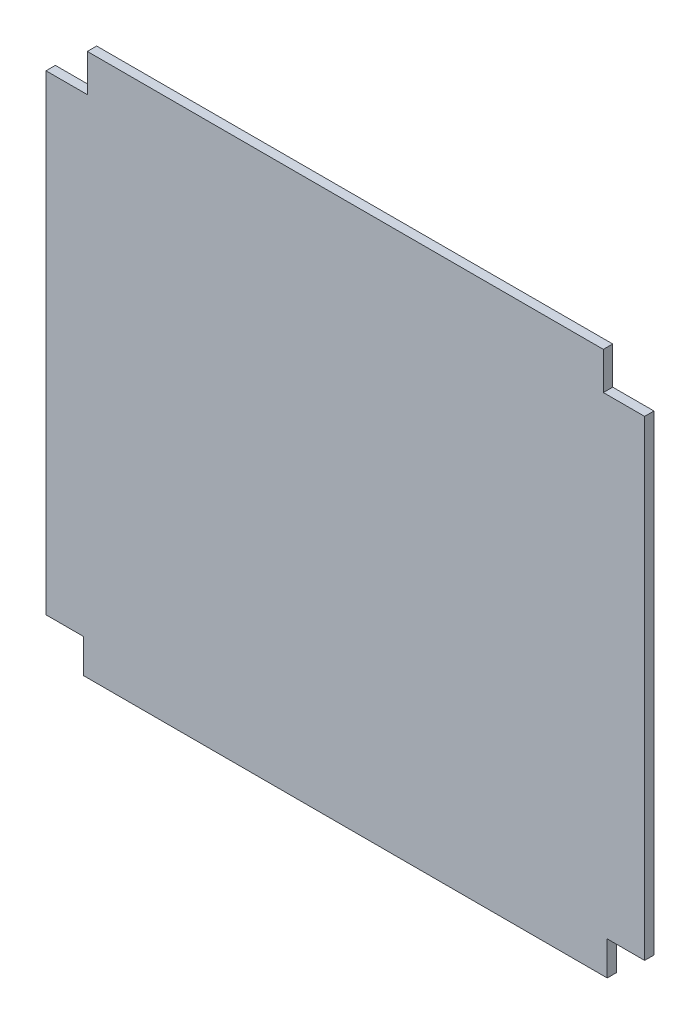
ISO-10303-21;
HEADER;
FILE_DESCRIPTION(('STEP AP214'),'2;1');
FILE_NAME('part.step','',(''),(''),'','','');
FILE_SCHEMA(('AUTOMOTIVE_DESIGN { 1 0 10303 214 1 1 1 1 }'));
ENDSEC;
DATA;
#1=APPLICATION_CONTEXT('core data for automotive mechanical design processes');
#2=APPLICATION_PROTOCOL_DEFINITION('international standard','automotive_design',2000,#1);
#3=PRODUCT_CONTEXT('',#1,'mechanical');
#4=PRODUCT('Part','Part','',(#3));
#5=PRODUCT_RELATED_PRODUCT_CATEGORY('part','',(#4));
#6=PRODUCT_DEFINITION_FORMATION('','',#4);
#7=PRODUCT_DEFINITION_CONTEXT('part definition',#1,'design');
#8=PRODUCT_DEFINITION('design','',#6,#7);
#9=PRODUCT_DEFINITION_SHAPE('','',#8);
#10=(LENGTH_UNIT() NAMED_UNIT(*) SI_UNIT(.MILLI.,.METRE.));
#11=(NAMED_UNIT(*) PLANE_ANGLE_UNIT() SI_UNIT($,.RADIAN.));
#12=(NAMED_UNIT(*) SI_UNIT($,.STERADIAN.) SOLID_ANGLE_UNIT());
#13=UNCERTAINTY_MEASURE_WITH_UNIT(LENGTH_MEASURE(1.E-05),#10,'distance_accuracy_value','');
#14=(GEOMETRIC_REPRESENTATION_CONTEXT(3) GLOBAL_UNCERTAINTY_ASSIGNED_CONTEXT((#13)) GLOBAL_UNIT_ASSIGNED_CONTEXT((#10,
#11,#12)) REPRESENTATION_CONTEXT('',''));
#15=CARTESIAN_POINT('',(0.,0.,0.));
#16=DIRECTION('',(0.,0.,1.));
#17=DIRECTION('',(1.,0.,0.));
#18=AXIS2_PLACEMENT_3D('',#15,#16,#17);
#19=CARTESIAN_POINT('',(280.,-290.,10.));
#20=DIRECTION('',(-1.,0.,0.));
#21=DIRECTION('',(0.,0.,1.));
#22=AXIS2_PLACEMENT_3D('',#19,#20,#21);
#23=PLANE('',#22);
#24=DIRECTION('',(0.,1.,0.));
#25=VECTOR('',#24,1.);
#26=CARTESIAN_POINT('',(280.,-290.,0.));
#27=LINE('',#26,#25);
#28=CARTESIAN_POINT('',(280.,-290.,0.));
#29=VERTEX_POINT('',#28);
#30=CARTESIAN_POINT('',(280.,-253.75,0.));
#31=VERTEX_POINT('',#30);
#32=EDGE_CURVE('E153',#29,#31,#27,.T.);
#33=ORIENTED_EDGE('',*,*,#32,.T.);
#34=DIRECTION('',(0.,0.,-1.));
#35=VECTOR('',#34,1.);
#36=CARTESIAN_POINT('',(280.,-253.75,10.));
#37=LINE('',#36,#35);
#38=CARTESIAN_POINT('',(280.,-253.75,10.));
#39=VERTEX_POINT('',#38);
#40=EDGE_CURVE('E11',#39,#31,#37,.T.);
#41=ORIENTED_EDGE('',*,*,#40,.F.);
#42=DIRECTION('',(0.,1.,0.));
#43=VECTOR('',#42,1.);
#44=CARTESIAN_POINT('',(280.,-290.,10.));
#45=LINE('',#44,#43);
#46=CARTESIAN_POINT('',(280.,-290.,10.));
#47=VERTEX_POINT('',#46);
#48=EDGE_CURVE('E175',#47,#39,#45,.T.);
#49=ORIENTED_EDGE('',*,*,#48,.F.);
#50=DIRECTION('',(0.,0.,-1.));
#51=VECTOR('',#50,1.);
#52=CARTESIAN_POINT('',(280.,-290.,10.));
#53=LINE('',#52,#51);
#54=EDGE_CURVE('E149',#47,#29,#53,.T.);
#55=ORIENTED_EDGE('',*,*,#54,.T.);
#56=EDGE_LOOP('',(#33,#41,#49,#55));
#57=FACE_BOUND('',#56,.T.);
#58=ADVANCED_FACE('F33',(#57),#23,.F.);
#59=CARTESIAN_POINT('',(320.,-253.75,10.));
#60=DIRECTION('',(0.,1.,0.));
#61=DIRECTION('',(0.,0.,1.));
#62=AXIS2_PLACEMENT_3D('',#59,#60,#61);
#63=PLANE('',#62);
#64=DIRECTION('',(1.,0.,0.));
#65=VECTOR('',#64,1.);
#66=CARTESIAN_POINT('',(320.,-253.75,0.));
#67=LINE('',#66,#65);
#68=CARTESIAN_POINT('',(320.,-253.75,0.));
#69=VERTEX_POINT('',#68);
#70=EDGE_CURVE('E156',#31,#69,#67,.T.);
#71=ORIENTED_EDGE('',*,*,#70,.T.);
#72=DIRECTION('',(0.,0.,-1.));
#73=VECTOR('',#72,1.);
#74=CARTESIAN_POINT('',(320.,-253.75,10.));
#75=LINE('',#74,#73);
#76=CARTESIAN_POINT('',(320.,-253.75,10.));
#77=VERTEX_POINT('',#76);
#78=EDGE_CURVE('E41',#77,#69,#75,.T.);
#79=ORIENTED_EDGE('',*,*,#78,.F.);
#80=DIRECTION('',(1.,0.,0.));
#81=VECTOR('',#80,1.);
#82=CARTESIAN_POINT('',(320.,-253.75,10.));
#83=LINE('',#82,#81);
#84=EDGE_CURVE('E104',#39,#77,#83,.T.);
#85=ORIENTED_EDGE('',*,*,#84,.F.);
#86=ORIENTED_EDGE('',*,*,#40,.T.);
#87=EDGE_LOOP('',(#71,#79,#85,#86));
#88=FACE_BOUND('',#87,.T.);
#89=ADVANCED_FACE('F253',(#88),#63,.F.);
#90=CARTESIAN_POINT('',(320.,-253.75,10.));
#91=DIRECTION('',(-1.,0.,0.));
#92=DIRECTION('',(0.,-1.,0.));
#93=AXIS2_PLACEMENT_3D('',#90,#91,#92);
#94=PLANE('',#93);
#95=DIRECTION('',(0.,1.,0.));
#96=VECTOR('',#95,1.);
#97=CARTESIAN_POINT('',(320.,-253.75,0.));
#98=LINE('',#97,#96);
#99=CARTESIAN_POINT('',(320.,250.,0.));
#100=VERTEX_POINT('',#99);
#101=EDGE_CURVE('E158',#69,#100,#98,.T.);
#102=ORIENTED_EDGE('',*,*,#101,.T.);
#103=DIRECTION('',(0.,0.,-1.));
#104=VECTOR('',#103,1.);
#105=CARTESIAN_POINT('',(320.,250.,10.));
#106=LINE('',#105,#104);
#107=CARTESIAN_POINT('',(320.,250.,10.));
#108=VERTEX_POINT('',#107);
#109=EDGE_CURVE('E194',#108,#100,#106,.T.);
#110=ORIENTED_EDGE('',*,*,#109,.F.);
#111=DIRECTION('',(0.,1.,0.));
#112=VECTOR('',#111,1.);
#113=CARTESIAN_POINT('',(320.,-253.75,10.));
#114=LINE('',#113,#112);
#115=EDGE_CURVE('E202',#77,#108,#114,.T.);
#116=ORIENTED_EDGE('',*,*,#115,.F.);
#117=ORIENTED_EDGE('',*,*,#78,.T.);
#118=EDGE_LOOP('',(#102,#110,#116,#117));
#119=FACE_BOUND('',#118,.T.);
#120=ADVANCED_FACE('F200',(#119),#94,.F.);
#121=CARTESIAN_POINT('',(320.,250.,10.));
#122=DIRECTION('',(0.,-1.,0.));
#123=DIRECTION('',(0.,0.,-1.));
#124=AXIS2_PLACEMENT_3D('',#121,#122,#123);
#125=PLANE('',#124);
#126=DIRECTION('',(-1.,0.,0.));
#127=VECTOR('',#126,1.);
#128=CARTESIAN_POINT('',(320.,250.,0.));
#129=LINE('',#128,#127);
#130=CARTESIAN_POINT('',(275.862068965517,250.,0.));
#131=VERTEX_POINT('',#130);
#132=EDGE_CURVE('E160',#100,#131,#129,.T.);
#133=ORIENTED_EDGE('',*,*,#132,.T.);
#134=DIRECTION('',(0.,0.,-1.));
#135=VECTOR('',#134,1.);
#136=CARTESIAN_POINT('',(275.862068965517,250.,10.));
#137=LINE('',#136,#135);
#138=CARTESIAN_POINT('',(275.862068965517,250.,10.));
#139=VERTEX_POINT('',#138);
#140=EDGE_CURVE('E191',#139,#131,#137,.T.);
#141=ORIENTED_EDGE('',*,*,#140,.F.);
#142=DIRECTION('',(-1.,0.,0.));
#143=VECTOR('',#142,1.);
#144=CARTESIAN_POINT('',(320.,250.,10.));
#145=LINE('',#144,#143);
#146=EDGE_CURVE('E220',#108,#139,#145,.T.);
#147=ORIENTED_EDGE('',*,*,#146,.F.);
#148=ORIENTED_EDGE('',*,*,#109,.T.);
#149=EDGE_LOOP('',(#133,#141,#147,#148));
#150=FACE_BOUND('',#149,.T.);
#151=ADVANCED_FACE('F211',(#150),#125,.F.);
#152=CARTESIAN_POINT('',(275.862068965517,290.,10.));
#153=DIRECTION('',(-1.,0.,0.));
#154=DIRECTION('',(0.,0.,1.));
#155=AXIS2_PLACEMENT_3D('',#152,#153,#154);
#156=PLANE('',#155);
#157=DIRECTION('',(0.,1.,0.));
#158=VECTOR('',#157,1.);
#159=CARTESIAN_POINT('',(275.862068965517,290.,0.));
#160=LINE('',#159,#158);
#161=CARTESIAN_POINT('',(275.862068965517,290.,0.));
#162=VERTEX_POINT('',#161);
#163=EDGE_CURVE('E162',#131,#162,#160,.T.);
#164=ORIENTED_EDGE('',*,*,#163,.T.);
#165=DIRECTION('',(0.,0.,-1.));
#166=VECTOR('',#165,1.);
#167=CARTESIAN_POINT('',(275.862068965517,290.,10.));
#168=LINE('',#167,#166);
#169=CARTESIAN_POINT('',(275.862068965517,290.,10.));
#170=VERTEX_POINT('',#169);
#171=EDGE_CURVE('E188',#170,#162,#168,.T.);
#172=ORIENTED_EDGE('',*,*,#171,.F.);
#173=DIRECTION('',(0.,1.,0.));
#174=VECTOR('',#173,1.);
#175=CARTESIAN_POINT('',(275.862068965517,290.,10.));
#176=LINE('',#175,#174);
#177=EDGE_CURVE('E217',#139,#170,#176,.T.);
#178=ORIENTED_EDGE('',*,*,#177,.F.);
#179=ORIENTED_EDGE('',*,*,#140,.T.);
#180=EDGE_LOOP('',(#164,#172,#178,#179));
#181=FACE_BOUND('',#180,.T.);
#182=ADVANCED_FACE('F215',(#181),#156,.F.);
#183=CARTESIAN_POINT('',(-275.862068965517,290.,10.));
#184=DIRECTION('',(0.,-1.,0.));
#185=DIRECTION('',(1.,0.,0.));
#186=AXIS2_PLACEMENT_3D('',#183,#184,#185);
#187=PLANE('',#186);
#188=DIRECTION('',(-1.,0.,0.));
#189=VECTOR('',#188,1.);
#190=CARTESIAN_POINT('',(-275.862068965517,290.,0.));
#191=LINE('',#190,#189);
#192=CARTESIAN_POINT('',(-275.862068965517,290.,0.));
#193=VERTEX_POINT('',#192);
#194=EDGE_CURVE('E164',#162,#193,#191,.T.);
#195=ORIENTED_EDGE('',*,*,#194,.T.);
#196=DIRECTION('',(0.,0.,-1.));
#197=VECTOR('',#196,1.);
#198=CARTESIAN_POINT('',(-275.862068965517,290.,10.));
#199=LINE('',#198,#197);
#200=CARTESIAN_POINT('',(-275.862068965517,290.,10.));
#201=VERTEX_POINT('',#200);
#202=EDGE_CURVE('E185',#201,#193,#199,.T.);
#203=ORIENTED_EDGE('',*,*,#202,.F.);
#204=DIRECTION('',(-1.,0.,0.));
#205=VECTOR('',#204,1.);
#206=CARTESIAN_POINT('',(-275.862068965517,290.,10.));
#207=LINE('',#206,#205);
#208=EDGE_CURVE('E219',#170,#201,#207,.T.);
#209=ORIENTED_EDGE('',*,*,#208,.F.);
#210=ORIENTED_EDGE('',*,*,#171,.T.);
#211=EDGE_LOOP('',(#195,#203,#209,#210));
#212=FACE_BOUND('',#211,.T.);
#213=ADVANCED_FACE('F266',(#212),#187,.F.);
#214=CARTESIAN_POINT('',(-275.862068965517,290.,10.));
#215=DIRECTION('',(1.,0.,0.));
#216=DIRECTION('',(0.,0.,-1.));
#217=AXIS2_PLACEMENT_3D('',#214,#215,#216);
#218=PLANE('',#217);
#219=DIRECTION('',(0.,-1.,0.));
#220=VECTOR('',#219,1.);
#221=CARTESIAN_POINT('',(-275.862068965517,290.,0.));
#222=LINE('',#221,#220);
#223=CARTESIAN_POINT('',(-275.862068965517,250.,0.));
#224=VERTEX_POINT('',#223);
#225=EDGE_CURVE('E166',#193,#224,#222,.T.);
#226=ORIENTED_EDGE('',*,*,#225,.T.);
#227=DIRECTION('',(0.,0.,-1.));
#228=VECTOR('',#227,1.);
#229=CARTESIAN_POINT('',(-275.862068965517,250.,10.));
#230=LINE('',#229,#228);
#231=CARTESIAN_POINT('',(-275.862068965517,250.,10.));
#232=VERTEX_POINT('',#231);
#233=EDGE_CURVE('E182',#232,#224,#230,.T.);
#234=ORIENTED_EDGE('',*,*,#233,.F.);
#235=DIRECTION('',(0.,-1.,0.));
#236=VECTOR('',#235,1.);
#237=CARTESIAN_POINT('',(-275.862068965517,290.,10.));
#238=LINE('',#237,#236);
#239=EDGE_CURVE('E222',#201,#232,#238,.T.);
#240=ORIENTED_EDGE('',*,*,#239,.F.);
#241=ORIENTED_EDGE('',*,*,#202,.T.);
#242=EDGE_LOOP('',(#226,#234,#240,#241));
#243=FACE_BOUND('',#242,.T.);
#244=ADVANCED_FACE('F269',(#243),#218,.F.);
#245=CARTESIAN_POINT('',(-320.,250.,10.));
#246=DIRECTION('',(0.,-1.,0.));
#247=DIRECTION('',(0.,0.,-1.));
#248=AXIS2_PLACEMENT_3D('',#245,#246,#247);
#249=PLANE('',#248);
#250=DIRECTION('',(-1.,0.,0.));
#251=VECTOR('',#250,1.);
#252=CARTESIAN_POINT('',(-320.,250.,0.));
#253=LINE('',#252,#251);
#254=CARTESIAN_POINT('',(-320.,250.,0.));
#255=VERTEX_POINT('',#254);
#256=EDGE_CURVE('E168',#224,#255,#253,.T.);
#257=ORIENTED_EDGE('',*,*,#256,.T.);
#258=DIRECTION('',(0.,0.,-1.));
#259=VECTOR('',#258,1.);
#260=CARTESIAN_POINT('',(-320.,250.,10.));
#261=LINE('',#260,#259);
#262=CARTESIAN_POINT('',(-320.,250.,10.));
#263=VERTEX_POINT('',#262);
#264=EDGE_CURVE('E179',#263,#255,#261,.T.);
#265=ORIENTED_EDGE('',*,*,#264,.F.);
#266=DIRECTION('',(-1.,0.,0.));
#267=VECTOR('',#266,1.);
#268=CARTESIAN_POINT('',(-320.,250.,10.));
#269=LINE('',#268,#267);
#270=EDGE_CURVE('E228',#232,#263,#269,.T.);
#271=ORIENTED_EDGE('',*,*,#270,.F.);
#272=ORIENTED_EDGE('',*,*,#233,.T.);
#273=EDGE_LOOP('',(#257,#265,#271,#272));
#274=FACE_BOUND('',#273,.T.);
#275=ADVANCED_FACE('F234',(#274),#249,.F.);
#276=CARTESIAN_POINT('',(-320.,-253.75,10.));
#277=DIRECTION('',(1.,0.,0.));
#278=DIRECTION('',(0.,1.,0.));
#279=AXIS2_PLACEMENT_3D('',#276,#277,#278);
#280=PLANE('',#279);
#281=DIRECTION('',(0.,-1.,0.));
#282=VECTOR('',#281,1.);
#283=CARTESIAN_POINT('',(-320.,-253.75,0.));
#284=LINE('',#283,#282);
#285=CARTESIAN_POINT('',(-320.,-253.75,0.));
#286=VERTEX_POINT('',#285);
#287=EDGE_CURVE('E170',#255,#286,#284,.T.);
#288=ORIENTED_EDGE('',*,*,#287,.T.);
#289=DIRECTION('',(0.,0.,-1.));
#290=VECTOR('',#289,1.);
#291=CARTESIAN_POINT('',(-320.,-253.75,10.));
#292=LINE('',#291,#290);
#293=CARTESIAN_POINT('',(-320.,-253.75,10.));
#294=VERTEX_POINT('',#293);
#295=EDGE_CURVE('E144',#294,#286,#292,.T.);
#296=ORIENTED_EDGE('',*,*,#295,.F.);
#297=DIRECTION('',(0.,-1.,0.));
#298=VECTOR('',#297,1.);
#299=CARTESIAN_POINT('',(-320.,-253.75,10.));
#300=LINE('',#299,#298);
#301=EDGE_CURVE('E135',#263,#294,#300,.T.);
#302=ORIENTED_EDGE('',*,*,#301,.F.);
#303=ORIENTED_EDGE('',*,*,#264,.T.);
#304=EDGE_LOOP('',(#288,#296,#302,#303));
#305=FACE_BOUND('',#304,.T.);
#306=ADVANCED_FACE('F238',(#305),#280,.F.);
#307=CARTESIAN_POINT('',(-320.,-253.75,10.));
#308=DIRECTION('',(0.,1.,0.));
#309=DIRECTION('',(0.,0.,1.));
#310=AXIS2_PLACEMENT_3D('',#307,#308,#309);
#311=PLANE('',#310);
#312=DIRECTION('',(1.,0.,0.));
#313=VECTOR('',#312,1.);
#314=CARTESIAN_POINT('',(-320.,-253.75,0.));
#315=LINE('',#314,#313);
#316=CARTESIAN_POINT('',(-280.,-253.75,0.));
#317=VERTEX_POINT('',#316);
#318=EDGE_CURVE('E143',#286,#317,#315,.T.);
#319=ORIENTED_EDGE('',*,*,#318,.T.);
#320=DIRECTION('',(0.,0.,-1.));
#321=VECTOR('',#320,1.);
#322=CARTESIAN_POINT('',(-280.,-253.75,10.));
#323=LINE('',#322,#321);
#324=CARTESIAN_POINT('',(-280.,-253.75,10.));
#325=VERTEX_POINT('',#324);
#326=EDGE_CURVE('E140',#325,#317,#323,.T.);
#327=ORIENTED_EDGE('',*,*,#326,.F.);
#328=DIRECTION('',(1.,0.,0.));
#329=VECTOR('',#328,1.);
#330=CARTESIAN_POINT('',(-320.,-253.75,10.));
#331=LINE('',#330,#329);
#332=EDGE_CURVE('E129',#294,#325,#331,.T.);
#333=ORIENTED_EDGE('',*,*,#332,.F.);
#334=ORIENTED_EDGE('',*,*,#295,.T.);
#335=EDGE_LOOP('',(#319,#327,#333,#334));
#336=FACE_BOUND('',#335,.T.);
#337=ADVANCED_FACE('F141',(#336),#311,.F.);
#338=CARTESIAN_POINT('',(-280.,-290.,10.));
#339=DIRECTION('',(1.,0.,0.));
#340=DIRECTION('',(0.,0.,-1.));
#341=AXIS2_PLACEMENT_3D('',#338,#339,#340);
#342=PLANE('',#341);
#343=DIRECTION('',(0.,-1.,0.));
#344=VECTOR('',#343,1.);
#345=CARTESIAN_POINT('',(-280.,-290.,0.));
#346=LINE('',#345,#344);
#347=CARTESIAN_POINT('',(-280.,-290.,0.));
#348=VERTEX_POINT('',#347);
#349=EDGE_CURVE('E90',#317,#348,#346,.T.);
#350=ORIENTED_EDGE('',*,*,#349,.T.);
#351=DIRECTION('',(0.,0.,-1.));
#352=VECTOR('',#351,1.);
#353=CARTESIAN_POINT('',(-280.,-290.,10.));
#354=LINE('',#353,#352);
#355=CARTESIAN_POINT('',(-280.,-290.,10.));
#356=VERTEX_POINT('',#355);
#357=EDGE_CURVE('E145',#356,#348,#354,.T.);
#358=ORIENTED_EDGE('',*,*,#357,.F.);
#359=DIRECTION('',(0.,-1.,0.));
#360=VECTOR('',#359,1.);
#361=CARTESIAN_POINT('',(-280.,-290.,10.));
#362=LINE('',#361,#360);
#363=EDGE_CURVE('E133',#325,#356,#362,.T.);
#364=ORIENTED_EDGE('',*,*,#363,.F.);
#365=ORIENTED_EDGE('',*,*,#326,.T.);
#366=EDGE_LOOP('',(#350,#358,#364,#365));
#367=FACE_BOUND('',#366,.T.);
#368=ADVANCED_FACE('F147',(#367),#342,.F.);
#369=CARTESIAN_POINT('',(-280.,-290.,10.));
#370=DIRECTION('',(0.,1.,0.));
#371=DIRECTION('',(-1.,0.,0.));
#372=AXIS2_PLACEMENT_3D('',#369,#370,#371);
#373=PLANE('',#372);
#374=DIRECTION('',(1.,0.,0.));
#375=VECTOR('',#374,1.);
#376=CARTESIAN_POINT('',(-280.,-290.,0.));
#377=LINE('',#376,#375);
#378=EDGE_CURVE('E96',#348,#29,#377,.T.);
#379=ORIENTED_EDGE('',*,*,#378,.T.);
#380=ORIENTED_EDGE('',*,*,#54,.F.);
#381=DIRECTION('',(1.,0.,0.));
#382=VECTOR('',#381,1.);
#383=CARTESIAN_POINT('',(-280.,-290.,10.));
#384=LINE('',#383,#382);
#385=EDGE_CURVE('E49',#356,#47,#384,.T.);
#386=ORIENTED_EDGE('',*,*,#385,.F.);
#387=ORIENTED_EDGE('',*,*,#357,.T.);
#388=EDGE_LOOP('',(#379,#380,#386,#387));
#389=FACE_BOUND('',#388,.T.);
#390=ADVANCED_FACE('F242',(#389),#373,.F.);
#391=CARTESIAN_POINT('',(0.,0.,10.));
#392=DIRECTION('',(0.,0.,1.));
#393=DIRECTION('',(1.,0.,0.));
#394=AXIS2_PLACEMENT_3D('',#391,#392,#393);
#395=PLANE('',#394);
#396=ORIENTED_EDGE('',*,*,#48,.T.);
#397=ORIENTED_EDGE('',*,*,#84,.T.);
#398=ORIENTED_EDGE('',*,*,#115,.T.);
#399=ORIENTED_EDGE('',*,*,#146,.T.);
#400=ORIENTED_EDGE('',*,*,#177,.T.);
#401=ORIENTED_EDGE('',*,*,#208,.T.);
#402=ORIENTED_EDGE('',*,*,#239,.T.);
#403=ORIENTED_EDGE('',*,*,#270,.T.);
#404=ORIENTED_EDGE('',*,*,#301,.T.);
#405=ORIENTED_EDGE('',*,*,#332,.T.);
#406=ORIENTED_EDGE('',*,*,#363,.T.);
#407=ORIENTED_EDGE('',*,*,#385,.T.);
#408=EDGE_LOOP('',(#396,#397,#398,#399,#400,#401,#402,#403,#404,#405,#406,#407));
#409=FACE_BOUND('',#408,.T.);
#410=ADVANCED_FACE('F131',(#409),#395,.T.);
#411=CARTESIAN_POINT('',(0.,0.,0.));
#412=DIRECTION('',(0.,0.,1.));
#413=DIRECTION('',(1.,0.,0.));
#414=AXIS2_PLACEMENT_3D('',#411,#412,#413);
#415=PLANE('',#414);
#416=ORIENTED_EDGE('',*,*,#32,.F.);
#417=ORIENTED_EDGE('',*,*,#378,.F.);
#418=ORIENTED_EDGE('',*,*,#349,.F.);
#419=ORIENTED_EDGE('',*,*,#318,.F.);
#420=ORIENTED_EDGE('',*,*,#287,.F.);
#421=ORIENTED_EDGE('',*,*,#256,.F.);
#422=ORIENTED_EDGE('',*,*,#225,.F.);
#423=ORIENTED_EDGE('',*,*,#194,.F.);
#424=ORIENTED_EDGE('',*,*,#163,.F.);
#425=ORIENTED_EDGE('',*,*,#132,.F.);
#426=ORIENTED_EDGE('',*,*,#101,.F.);
#427=ORIENTED_EDGE('',*,*,#70,.F.);
#428=EDGE_LOOP('',(#416,#417,#418,#419,#420,#421,#422,#423,#424,#425,#426,#427));
#429=FACE_BOUND('',#428,.T.);
#430=ADVANCED_FACE('F206',(#429),#415,.F.);
#431=CLOSED_SHELL('',(#58,#89,#120,#151,#182,#213,#244,#275,#306,#337,#368,#390,#410,#430));
#432=MANIFOLD_SOLID_BREP('B2',#431);
#433=ADVANCED_BREP_SHAPE_REPRESENTATION('',(#18,#432),#14);
#434=SHAPE_DEFINITION_REPRESENTATION(#9,#433);
ENDSEC;
END-ISO-10303-21;
